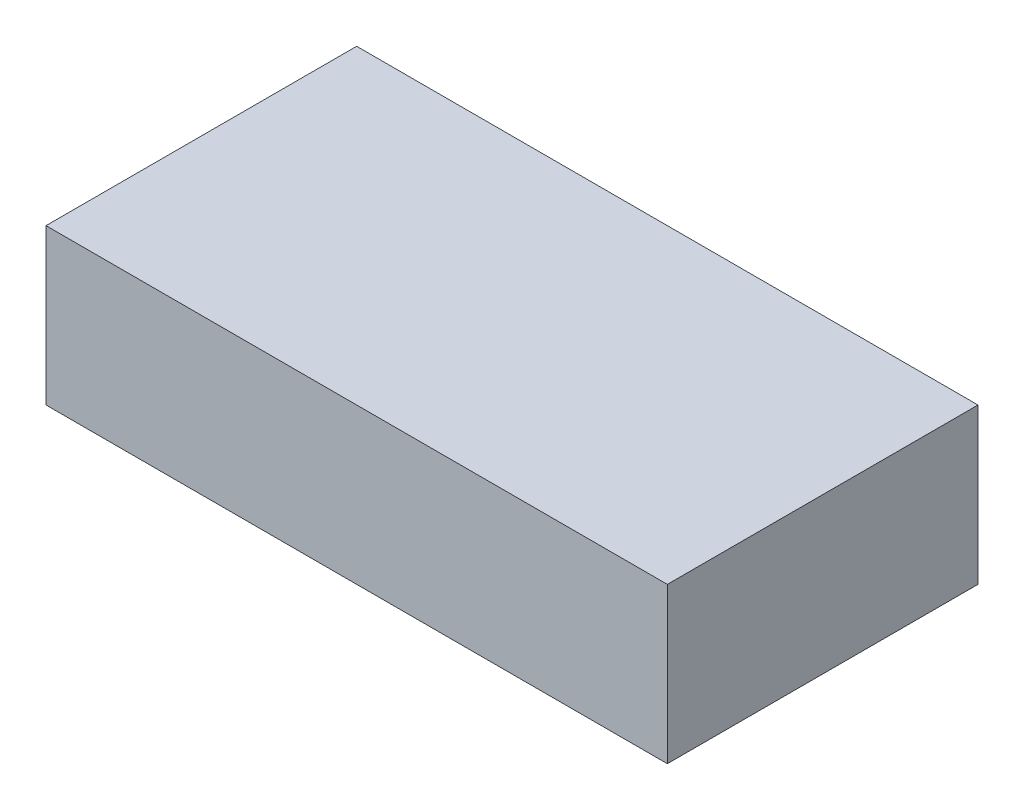
ISO-10303-21;
HEADER;
FILE_DESCRIPTION(('STEP AP214'),'2;1');
FILE_NAME('part.step','',(''),(''),'','','');
FILE_SCHEMA(('AUTOMOTIVE_DESIGN { 1 0 10303 214 1 1 1 1 }'));
ENDSEC;
DATA;
#1=APPLICATION_CONTEXT('core data for automotive mechanical design processes');
#2=APPLICATION_PROTOCOL_DEFINITION('international standard','automotive_design',2000,#1);
#3=PRODUCT_CONTEXT('',#1,'mechanical');
#4=PRODUCT('Part','Part','',(#3));
#5=PRODUCT_RELATED_PRODUCT_CATEGORY('part','',(#4));
#6=PRODUCT_DEFINITION_FORMATION('','',#4);
#7=PRODUCT_DEFINITION_CONTEXT('part definition',#1,'design');
#8=PRODUCT_DEFINITION('design','',#6,#7);
#9=PRODUCT_DEFINITION_SHAPE('','',#8);
#10=(LENGTH_UNIT() NAMED_UNIT(*) SI_UNIT(.MILLI.,.METRE.));
#11=(NAMED_UNIT(*) PLANE_ANGLE_UNIT() SI_UNIT($,.RADIAN.));
#12=(NAMED_UNIT(*) SI_UNIT($,.STERADIAN.) SOLID_ANGLE_UNIT());
#13=UNCERTAINTY_MEASURE_WITH_UNIT(LENGTH_MEASURE(1.E-05),#10,'distance_accuracy_value','');
#14=(GEOMETRIC_REPRESENTATION_CONTEXT(3) GLOBAL_UNCERTAINTY_ASSIGNED_CONTEXT((#13)) GLOBAL_UNIT_ASSIGNED_CONTEXT((#10,
#11,#12)) REPRESENTATION_CONTEXT('',''));
#15=CARTESIAN_POINT('',(0.,0.,0.));
#16=DIRECTION('',(0.,0.,1.));
#17=DIRECTION('',(1.,0.,0.));
#18=AXIS2_PLACEMENT_3D('',#15,#16,#17);
#19=CARTESIAN_POINT('',(0.,6.35,0.));
#20=DIRECTION('',(1.,0.,0.));
#21=DIRECTION('',(0.,0.,-1.));
#22=AXIS2_PLACEMENT_3D('',#19,#20,#21);
#23=PLANE('',#22);
#24=DIRECTION('',(0.,0.,1.));
#25=VECTOR('',#24,1.);
#26=CARTESIAN_POINT('',(0.,-6.35,0.));
#27=LINE('',#26,#25);
#28=CARTESIAN_POINT('',(0.,-6.35,-25.4));
#29=VERTEX_POINT('',#28);
#30=CARTESIAN_POINT('',(0.,-6.35,0.));
#31=VERTEX_POINT('',#30);
#32=EDGE_CURVE('E96',#29,#31,#27,.T.);
#33=ORIENTED_EDGE('',*,*,#32,.T.);
#34=DIRECTION('',(0.,-1.,0.));
#35=VECTOR('',#34,1.);
#36=CARTESIAN_POINT('',(0.,6.35,0.));
#37=LINE('',#36,#35);
#38=CARTESIAN_POINT('',(0.,6.35,0.));
#39=VERTEX_POINT('',#38);
#40=EDGE_CURVE('E11',#39,#31,#37,.T.);
#41=ORIENTED_EDGE('',*,*,#40,.F.);
#42=DIRECTION('',(0.,0.,1.));
#43=VECTOR('',#42,1.);
#44=CARTESIAN_POINT('',(0.,6.35,0.));
#45=LINE('',#44,#43);
#46=CARTESIAN_POINT('',(0.,6.35,-25.4));
#47=VERTEX_POINT('',#46);
#48=EDGE_CURVE('E84',#47,#39,#45,.T.);
#49=ORIENTED_EDGE('',*,*,#48,.F.);
#50=DIRECTION('',(0.,-1.,0.));
#51=VECTOR('',#50,1.);
#52=CARTESIAN_POINT('',(0.,6.35,-25.4));
#53=LINE('',#52,#51);
#54=EDGE_CURVE('E92',#47,#29,#53,.T.);
#55=ORIENTED_EDGE('',*,*,#54,.T.);
#56=EDGE_LOOP('',(#33,#41,#49,#55));
#57=FACE_BOUND('',#56,.T.);
#58=ADVANCED_FACE('F33',(#57),#23,.F.);
#59=CARTESIAN_POINT('',(0.,6.35,0.));
#60=DIRECTION('',(0.,0.,-1.));
#61=DIRECTION('',(-1.,0.,0.));
#62=AXIS2_PLACEMENT_3D('',#59,#60,#61);
#63=PLANE('',#62);
#64=DIRECTION('',(1.,0.,0.));
#65=VECTOR('',#64,1.);
#66=CARTESIAN_POINT('',(0.,-6.35,0.));
#67=LINE('',#66,#65);
#68=CARTESIAN_POINT('',(50.8,-6.35,0.));
#69=VERTEX_POINT('',#68);
#70=EDGE_CURVE('E88',#31,#69,#67,.T.);
#71=ORIENTED_EDGE('',*,*,#70,.T.);
#72=DIRECTION('',(0.,-1.,0.));
#73=VECTOR('',#72,1.);
#74=CARTESIAN_POINT('',(50.8,6.35,0.));
#75=LINE('',#74,#73);
#76=CARTESIAN_POINT('',(50.8,6.35,0.));
#77=VERTEX_POINT('',#76);
#78=EDGE_CURVE('E41',#77,#69,#75,.T.);
#79=ORIENTED_EDGE('',*,*,#78,.F.);
#80=DIRECTION('',(1.,0.,0.));
#81=VECTOR('',#80,1.);
#82=CARTESIAN_POINT('',(0.,6.35,0.));
#83=LINE('',#82,#81);
#84=EDGE_CURVE('E79',#39,#77,#83,.T.);
#85=ORIENTED_EDGE('',*,*,#84,.F.);
#86=ORIENTED_EDGE('',*,*,#40,.T.);
#87=EDGE_LOOP('',(#71,#79,#85,#86));
#88=FACE_BOUND('',#87,.T.);
#89=ADVANCED_FACE('F87',(#88),#63,.F.);
#90=CARTESIAN_POINT('',(50.8,6.35,0.));
#91=DIRECTION('',(-1.,0.,0.));
#92=DIRECTION('',(0.,0.,1.));
#93=AXIS2_PLACEMENT_3D('',#90,#91,#92);
#94=PLANE('',#93);
#95=DIRECTION('',(0.,0.,-1.));
#96=VECTOR('',#95,1.);
#97=CARTESIAN_POINT('',(50.8,-6.35,0.));
#98=LINE('',#97,#96);
#99=CARTESIAN_POINT('',(50.8,-6.35,-25.4));
#100=VERTEX_POINT('',#99);
#101=EDGE_CURVE('E66',#69,#100,#98,.T.);
#102=ORIENTED_EDGE('',*,*,#101,.T.);
#103=DIRECTION('',(0.,-1.,0.));
#104=VECTOR('',#103,1.);
#105=CARTESIAN_POINT('',(50.8,6.35,-25.4));
#106=LINE('',#105,#104);
#107=CARTESIAN_POINT('',(50.8,6.35,-25.4));
#108=VERTEX_POINT('',#107);
#109=EDGE_CURVE('E89',#108,#100,#106,.T.);
#110=ORIENTED_EDGE('',*,*,#109,.F.);
#111=DIRECTION('',(0.,0.,-1.));
#112=VECTOR('',#111,1.);
#113=CARTESIAN_POINT('',(50.8,6.35,0.));
#114=LINE('',#113,#112);
#115=EDGE_CURVE('E82',#77,#108,#114,.T.);
#116=ORIENTED_EDGE('',*,*,#115,.F.);
#117=ORIENTED_EDGE('',*,*,#78,.T.);
#118=EDGE_LOOP('',(#102,#110,#116,#117));
#119=FACE_BOUND('',#118,.T.);
#120=ADVANCED_FACE('F90',(#119),#94,.F.);
#121=CARTESIAN_POINT('',(0.,6.35,-25.4));
#122=DIRECTION('',(0.,0.,1.));
#123=DIRECTION('',(1.,0.,0.));
#124=AXIS2_PLACEMENT_3D('',#121,#122,#123);
#125=PLANE('',#124);
#126=DIRECTION('',(-1.,0.,0.));
#127=VECTOR('',#126,1.);
#128=CARTESIAN_POINT('',(0.,-6.35,-25.4));
#129=LINE('',#128,#127);
#130=EDGE_CURVE('E72',#100,#29,#129,.T.);
#131=ORIENTED_EDGE('',*,*,#130,.T.);
#132=ORIENTED_EDGE('',*,*,#54,.F.);
#133=DIRECTION('',(-1.,0.,0.));
#134=VECTOR('',#133,1.);
#135=CARTESIAN_POINT('',(0.,6.35,-25.4));
#136=LINE('',#135,#134);
#137=EDGE_CURVE('E49',#108,#47,#136,.T.);
#138=ORIENTED_EDGE('',*,*,#137,.F.);
#139=ORIENTED_EDGE('',*,*,#109,.T.);
#140=EDGE_LOOP('',(#131,#132,#138,#139));
#141=FACE_BOUND('',#140,.T.);
#142=ADVANCED_FACE('F103',(#141),#125,.F.);
#143=CARTESIAN_POINT('',(0.,6.35,0.));
#144=DIRECTION('',(0.,-1.,0.));
#145=DIRECTION('',(0.,0.,-1.));
#146=AXIS2_PLACEMENT_3D('',#143,#144,#145);
#147=PLANE('',#146);
#148=ORIENTED_EDGE('',*,*,#48,.T.);
#149=ORIENTED_EDGE('',*,*,#84,.T.);
#150=ORIENTED_EDGE('',*,*,#115,.T.);
#151=ORIENTED_EDGE('',*,*,#137,.T.);
#152=EDGE_LOOP('',(#148,#149,#150,#151));
#153=FACE_BOUND('',#152,.T.);
#154=ADVANCED_FACE('F80',(#153),#147,.F.);
#155=CARTESIAN_POINT('',(0.,-6.35,0.));
#156=DIRECTION('',(0.,-1.,0.));
#157=DIRECTION('',(0.,0.,-1.));
#158=AXIS2_PLACEMENT_3D('',#155,#156,#157);
#159=PLANE('',#158);
#160=ORIENTED_EDGE('',*,*,#32,.F.);
#161=ORIENTED_EDGE('',*,*,#130,.F.);
#162=ORIENTED_EDGE('',*,*,#101,.F.);
#163=ORIENTED_EDGE('',*,*,#70,.F.);
#164=EDGE_LOOP('',(#160,#161,#162,#163));
#165=FACE_BOUND('',#164,.T.);
#166=ADVANCED_FACE('F106',(#165),#159,.T.);
#167=CLOSED_SHELL('',(#58,#89,#120,#142,#154,#166));
#168=MANIFOLD_SOLID_BREP('B2',#167);
#169=ADVANCED_BREP_SHAPE_REPRESENTATION('',(#18,#168),#14);
#170=SHAPE_DEFINITION_REPRESENTATION(#9,#169);
ENDSEC;
END-ISO-10303-21;
